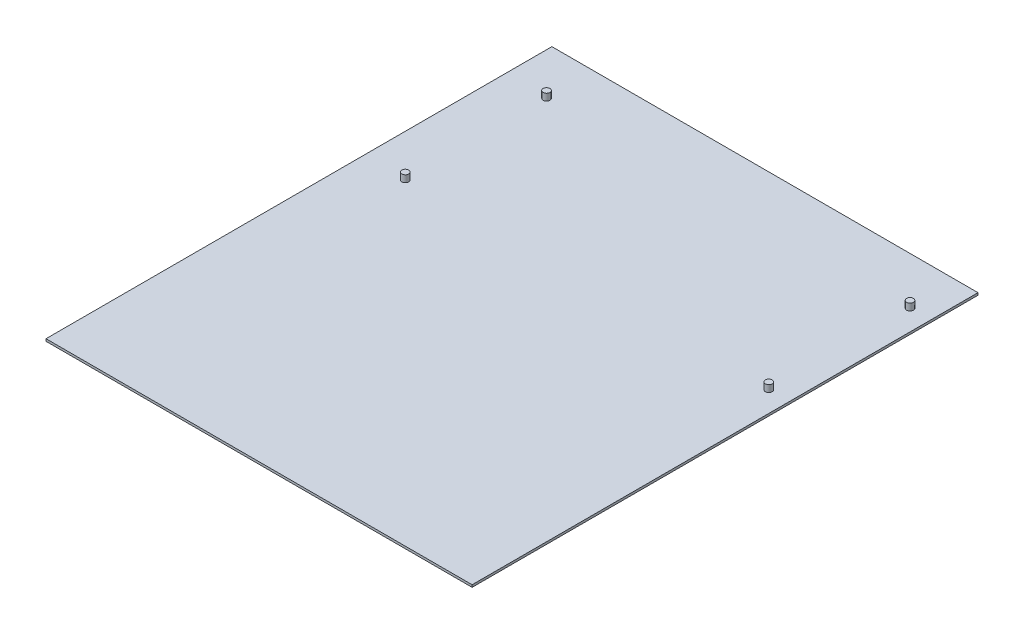
ISO-10303-21;
HEADER;
FILE_DESCRIPTION(('STEP AP214'),'2;1');
FILE_NAME('part.step','',(''),(''),'','','');
FILE_SCHEMA(('AUTOMOTIVE_DESIGN { 1 0 10303 214 1 1 1 1 }'));
ENDSEC;
DATA;
#1=APPLICATION_CONTEXT('core data for automotive mechanical design processes');
#2=APPLICATION_PROTOCOL_DEFINITION('international standard','automotive_design',2000,#1);
#3=PRODUCT_CONTEXT('',#1,'mechanical');
#4=PRODUCT('Part','Part','',(#3));
#5=PRODUCT_RELATED_PRODUCT_CATEGORY('part','',(#4));
#6=PRODUCT_DEFINITION_FORMATION('','',#4);
#7=PRODUCT_DEFINITION_CONTEXT('part definition',#1,'design');
#8=PRODUCT_DEFINITION('design','',#6,#7);
#9=PRODUCT_DEFINITION_SHAPE('','',#8);
#10=(LENGTH_UNIT() NAMED_UNIT(*) SI_UNIT(.MILLI.,.METRE.));
#11=(NAMED_UNIT(*) PLANE_ANGLE_UNIT() SI_UNIT($,.RADIAN.));
#12=(NAMED_UNIT(*) SI_UNIT($,.STERADIAN.) SOLID_ANGLE_UNIT());
#13=UNCERTAINTY_MEASURE_WITH_UNIT(LENGTH_MEASURE(1.E-05),#10,'distance_accuracy_value','');
#14=(GEOMETRIC_REPRESENTATION_CONTEXT(3) GLOBAL_UNCERTAINTY_ASSIGNED_CONTEXT((#13)) GLOBAL_UNIT_ASSIGNED_CONTEXT((#10,
#11,#12)) REPRESENTATION_CONTEXT('',''));
#15=CARTESIAN_POINT('',(0.,0.,0.));
#16=DIRECTION('',(0.,0.,1.));
#17=DIRECTION('',(1.,0.,0.));
#18=AXIS2_PLACEMENT_3D('',#15,#16,#17);
#19=CARTESIAN_POINT('',(-56.1029412418748,1.,35.5374216007363));
#20=DIRECTION('',(0.,1.,0.));
#21=DIRECTION('',(0.,0.,1.));
#22=AXIS2_PLACEMENT_3D('',#19,#20,#21);
#23=PLANE('',#22);
#24=CARTESIAN_POINT('',(121.897058758125,1.,-103.656578399264));
#25=DIRECTION('',(0.,1.,0.));
#26=DIRECTION('',(0.,0.,1.));
#27=AXIS2_PLACEMENT_3D('',#24,#25,#26);
#28=CIRCLE('',#27,1.5);
#29=CARTESIAN_POINT('',(121.897058758125,1.,-102.156578399264));
#30=VERTEX_POINT('',#29);
#31=EDGE_CURVE('E123',#30,#30,#28,.T.);
#32=ORIENTED_EDGE('',*,*,#31,.F.);
#33=EDGE_LOOP('',(#32));
#34=FACE_BOUND('',#33,.T.);
#35=CARTESIAN_POINT('',(121.897058758125,1.,-165.632578399264));
#36=DIRECTION('',(0.,1.,0.));
#37=DIRECTION('',(0.,0.,1.));
#38=AXIS2_PLACEMENT_3D('',#35,#36,#37);
#39=CIRCLE('',#38,1.5);
#40=CARTESIAN_POINT('',(121.897058758125,1.,-164.132578399264));
#41=VERTEX_POINT('',#40);
#42=EDGE_CURVE('E111',#41,#41,#39,.T.);
#43=ORIENTED_EDGE('',*,*,#42,.F.);
#44=EDGE_LOOP('',(#43));
#45=FACE_BOUND('',#44,.T.);
#46=DIRECTION('',(0.,0.,1.));
#47=VECTOR('',#46,1.);
#48=CARTESIAN_POINT('',(-56.1029412418748,1.,-186.462578399264));
#49=LINE('',#48,#47);
#50=CARTESIAN_POINT('',(-56.1029412418748,1.,-186.462578399264));
#51=VERTEX_POINT('',#50);
#52=CARTESIAN_POINT('',(-56.1029412418748,1.,35.5374216007363));
#53=VERTEX_POINT('',#52);
#54=EDGE_CURVE('E85',#51,#53,#49,.T.);
#55=ORIENTED_EDGE('',*,*,#54,.T.);
#56=DIRECTION('',(1.,0.,0.));
#57=VECTOR('',#56,1.);
#58=CARTESIAN_POINT('',(-56.1029412418748,1.,35.5374216007363));
#59=LINE('',#58,#57);
#60=CARTESIAN_POINT('',(130.897058758125,1.,35.5374216007363));
#61=VERTEX_POINT('',#60);
#62=EDGE_CURVE('E80',#53,#61,#59,.T.);
#63=ORIENTED_EDGE('',*,*,#62,.T.);
#64=DIRECTION('',(0.,0.,-1.));
#65=VECTOR('',#64,1.);
#66=CARTESIAN_POINT('',(130.897058758125,1.,-186.462578399264));
#67=LINE('',#66,#65);
#68=CARTESIAN_POINT('',(130.897058758125,1.,-186.462578399264));
#69=VERTEX_POINT('',#68);
#70=EDGE_CURVE('E83',#61,#69,#67,.T.);
#71=ORIENTED_EDGE('',*,*,#70,.T.);
#72=DIRECTION('',(-1.,0.,0.));
#73=VECTOR('',#72,1.);
#74=CARTESIAN_POINT('',(-56.1029412418748,1.,-186.462578399264));
#75=LINE('',#74,#73);
#76=EDGE_CURVE('E50',#69,#51,#75,.T.);
#77=ORIENTED_EDGE('',*,*,#76,.T.);
#78=EDGE_LOOP('',(#55,#63,#71,#77));
#79=FACE_BOUND('',#78,.T.);
#80=CARTESIAN_POINT('',(-37.6149412418748,1.,-165.632578399264));
#81=DIRECTION('',(0.,1.,0.));
#82=DIRECTION('',(0.,0.,1.));
#83=AXIS2_PLACEMENT_3D('',#80,#81,#82);
#84=CIRCLE('',#83,1.5);
#85=CARTESIAN_POINT('',(-37.6149412418748,1.,-164.132578399264));
#86=VERTEX_POINT('',#85);
#87=EDGE_CURVE('E117',#86,#86,#84,.T.);
#88=ORIENTED_EDGE('',*,*,#87,.F.);
#89=EDGE_LOOP('',(#88));
#90=FACE_BOUND('',#89,.T.);
#91=CARTESIAN_POINT('',(-37.6149412418748,1.,-103.652578399264));
#92=DIRECTION('',(0.,1.,0.));
#93=DIRECTION('',(0.,0.,1.));
#94=AXIS2_PLACEMENT_3D('',#91,#92,#93);
#95=CIRCLE('',#94,1.5);
#96=CARTESIAN_POINT('',(-37.6149412418748,1.,-102.152578399264));
#97=VERTEX_POINT('',#96);
#98=EDGE_CURVE('E129',#97,#97,#95,.T.);
#99=ORIENTED_EDGE('',*,*,#98,.F.);
#100=EDGE_LOOP('',(#99));
#101=FACE_BOUND('',#100,.T.);
#102=ADVANCED_FACE('F33',(#34,#45,#79,#90,#101),#23,.T.);
#103=CARTESIAN_POINT('',(-56.1029412418748,1.,-186.462578399264));
#104=DIRECTION('',(1.,0.,0.));
#105=DIRECTION('',(0.,0.,-1.));
#106=AXIS2_PLACEMENT_3D('',#103,#104,#105);
#107=PLANE('',#106);
#108=DIRECTION('',(0.,0.,1.));
#109=VECTOR('',#108,1.);
#110=CARTESIAN_POINT('',(-56.1029412418748,0.,-186.462578399264));
#111=LINE('',#110,#109);
#112=CARTESIAN_POINT('',(-56.1029412418748,0.,-186.462578399264));
#113=VERTEX_POINT('',#112);
#114=CARTESIAN_POINT('',(-56.1029412418748,0.,35.5374216007363));
#115=VERTEX_POINT('',#114);
#116=EDGE_CURVE('E97',#113,#115,#111,.T.);
#117=ORIENTED_EDGE('',*,*,#116,.T.);
#118=DIRECTION('',(0.,-1.,0.));
#119=VECTOR('',#118,1.);
#120=CARTESIAN_POINT('',(-56.1029412418748,1.,35.5374216007363));
#121=LINE('',#120,#119);
#122=EDGE_CURVE('E11',#53,#115,#121,.T.);
#123=ORIENTED_EDGE('',*,*,#122,.F.);
#124=ORIENTED_EDGE('',*,*,#54,.F.);
#125=DIRECTION('',(0.,-1.,0.));
#126=VECTOR('',#125,1.);
#127=CARTESIAN_POINT('',(-56.1029412418748,1.,-186.462578399264));
#128=LINE('',#127,#126);
#129=EDGE_CURVE('E93',#51,#113,#128,.T.);
#130=ORIENTED_EDGE('',*,*,#129,.T.);
#131=EDGE_LOOP('',(#117,#123,#124,#130));
#132=FACE_BOUND('',#131,.T.);
#133=ADVANCED_FACE('F35',(#132),#107,.F.);
#134=CARTESIAN_POINT('',(-56.1029412418748,1.,35.5374216007363));
#135=DIRECTION('',(0.,0.,-1.));
#136=DIRECTION('',(-1.,0.,0.));
#137=AXIS2_PLACEMENT_3D('',#134,#135,#136);
#138=PLANE('',#137);
#139=DIRECTION('',(1.,0.,0.));
#140=VECTOR('',#139,1.);
#141=CARTESIAN_POINT('',(-56.1029412418748,0.,35.5374216007363));
#142=LINE('',#141,#140);
#143=CARTESIAN_POINT('',(130.897058758125,0.,35.5374216007363));
#144=VERTEX_POINT('',#143);
#145=EDGE_CURVE('E89',#115,#144,#142,.T.);
#146=ORIENTED_EDGE('',*,*,#145,.T.);
#147=DIRECTION('',(0.,-1.,0.));
#148=VECTOR('',#147,1.);
#149=CARTESIAN_POINT('',(130.897058758125,1.,35.5374216007363));
#150=LINE('',#149,#148);
#151=EDGE_CURVE('E42',#61,#144,#150,.T.);
#152=ORIENTED_EDGE('',*,*,#151,.F.);
#153=ORIENTED_EDGE('',*,*,#62,.F.);
#154=ORIENTED_EDGE('',*,*,#122,.T.);
#155=EDGE_LOOP('',(#146,#152,#153,#154));
#156=FACE_BOUND('',#155,.T.);
#157=ADVANCED_FACE('F88',(#156),#138,.F.);
#158=CARTESIAN_POINT('',(130.897058758125,1.,-186.462578399264));
#159=DIRECTION('',(-1.,0.,0.));
#160=DIRECTION('',(0.,0.,1.));
#161=AXIS2_PLACEMENT_3D('',#158,#159,#160);
#162=PLANE('',#161);
#163=DIRECTION('',(0.,0.,-1.));
#164=VECTOR('',#163,1.);
#165=CARTESIAN_POINT('',(130.897058758125,0.,-186.462578399264));
#166=LINE('',#165,#164);
#167=CARTESIAN_POINT('',(130.897058758125,0.,-186.462578399264));
#168=VERTEX_POINT('',#167);
#169=EDGE_CURVE('E67',#144,#168,#166,.T.);
#170=ORIENTED_EDGE('',*,*,#169,.T.);
#171=DIRECTION('',(0.,-1.,0.));
#172=VECTOR('',#171,1.);
#173=CARTESIAN_POINT('',(130.897058758125,1.,-186.462578399264));
#174=LINE('',#173,#172);
#175=EDGE_CURVE('E90',#69,#168,#174,.T.);
#176=ORIENTED_EDGE('',*,*,#175,.F.);
#177=ORIENTED_EDGE('',*,*,#70,.F.);
#178=ORIENTED_EDGE('',*,*,#151,.T.);
#179=EDGE_LOOP('',(#170,#176,#177,#178));
#180=FACE_BOUND('',#179,.T.);
#181=ADVANCED_FACE('F91',(#180),#162,.F.);
#182=CARTESIAN_POINT('',(-56.1029412418748,1.,-186.462578399264));
#183=DIRECTION('',(0.,0.,1.));
#184=DIRECTION('',(1.,0.,0.));
#185=AXIS2_PLACEMENT_3D('',#182,#183,#184);
#186=PLANE('',#185);
#187=DIRECTION('',(-1.,0.,0.));
#188=VECTOR('',#187,1.);
#189=CARTESIAN_POINT('',(-56.1029412418748,0.,-186.462578399264));
#190=LINE('',#189,#188);
#191=EDGE_CURVE('E73',#168,#113,#190,.T.);
#192=ORIENTED_EDGE('',*,*,#191,.T.);
#193=ORIENTED_EDGE('',*,*,#129,.F.);
#194=ORIENTED_EDGE('',*,*,#76,.F.);
#195=ORIENTED_EDGE('',*,*,#175,.T.);
#196=EDGE_LOOP('',(#192,#193,#194,#195));
#197=FACE_BOUND('',#196,.T.);
#198=ADVANCED_FACE('F105',(#197),#186,.F.);
#199=CARTESIAN_POINT('',(-56.1029412418748,0.,35.5374216007363));
#200=DIRECTION('',(0.,1.,0.));
#201=DIRECTION('',(0.,0.,1.));
#202=AXIS2_PLACEMENT_3D('',#199,#200,#201);
#203=PLANE('',#202);
#204=ORIENTED_EDGE('',*,*,#116,.F.);
#205=ORIENTED_EDGE('',*,*,#191,.F.);
#206=ORIENTED_EDGE('',*,*,#169,.F.);
#207=ORIENTED_EDGE('',*,*,#145,.F.);
#208=EDGE_LOOP('',(#204,#205,#206,#207));
#209=FACE_BOUND('',#208,.T.);
#210=ADVANCED_FACE('F108',(#209),#203,.F.);
#211=CARTESIAN_POINT('',(121.897058758125,4.,-165.632578399264));
#212=DIRECTION('',(0.,-1.,0.));
#213=DIRECTION('',(0.,0.,-1.));
#214=AXIS2_PLACEMENT_3D('',#211,#212,#213);
#215=CYLINDRICAL_SURFACE('',#214,1.5);
#216=CARTESIAN_POINT('',(121.897058758125,4.,-165.632578399264));
#217=DIRECTION('',(0.,1.,0.));
#218=DIRECTION('',(0.,0.,1.));
#219=AXIS2_PLACEMENT_3D('',#216,#217,#218);
#220=CIRCLE('',#219,1.5);
#221=CARTESIAN_POINT('',(121.897058758125,4.,-164.132578399264));
#222=VERTEX_POINT('',#221);
#223=EDGE_CURVE('E100',#222,#222,#220,.T.);
#224=ORIENTED_EDGE('',*,*,#223,.F.);
#225=EDGE_LOOP('',(#224));
#226=FACE_BOUND('',#225,.T.);
#227=ORIENTED_EDGE('',*,*,#42,.T.);
#228=EDGE_LOOP('',(#227));
#229=FACE_BOUND('',#228,.T.);
#230=ADVANCED_FACE('F156',(#226,#229),#215,.T.);
#231=CARTESIAN_POINT('',(121.897058758125,4.,-165.632578399264));
#232=DIRECTION('',(0.,1.,0.));
#233=DIRECTION('',(0.,0.,1.));
#234=AXIS2_PLACEMENT_3D('',#231,#232,#233);
#235=PLANE('',#234);
#236=ORIENTED_EDGE('',*,*,#223,.T.);
#237=EDGE_LOOP('',(#236));
#238=FACE_BOUND('',#237,.T.);
#239=ADVANCED_FACE('F189',(#238),#235,.T.);
#240=CARTESIAN_POINT('',(-37.6149412418748,4.,-165.632578399264));
#241=DIRECTION('',(0.,-1.,0.));
#242=DIRECTION('',(0.,0.,-1.));
#243=AXIS2_PLACEMENT_3D('',#240,#241,#242);
#244=CYLINDRICAL_SURFACE('',#243,1.5);
#245=CARTESIAN_POINT('',(-37.6149412418748,4.,-165.632578399264));
#246=DIRECTION('',(0.,1.,0.));
#247=DIRECTION('',(0.,0.,1.));
#248=AXIS2_PLACEMENT_3D('',#245,#246,#247);
#249=CIRCLE('',#248,1.5);
#250=CARTESIAN_POINT('',(-37.6149412418748,4.,-164.132578399264));
#251=VERTEX_POINT('',#250);
#252=EDGE_CURVE('E114',#251,#251,#249,.T.);
#253=ORIENTED_EDGE('',*,*,#252,.F.);
#254=EDGE_LOOP('',(#253));
#255=FACE_BOUND('',#254,.T.);
#256=ORIENTED_EDGE('',*,*,#87,.T.);
#257=EDGE_LOOP('',(#256));
#258=FACE_BOUND('',#257,.T.);
#259=ADVANCED_FACE('F195',(#255,#258),#244,.T.);
#260=CARTESIAN_POINT('',(-37.6149412418748,4.,-165.632578399264));
#261=DIRECTION('',(0.,1.,0.));
#262=DIRECTION('',(0.,0.,1.));
#263=AXIS2_PLACEMENT_3D('',#260,#261,#262);
#264=PLANE('',#263);
#265=ORIENTED_EDGE('',*,*,#252,.T.);
#266=EDGE_LOOP('',(#265));
#267=FACE_BOUND('',#266,.T.);
#268=ADVANCED_FACE('F202',(#267),#264,.T.);
#269=CARTESIAN_POINT('',(121.897058758125,4.,-103.656578399264));
#270=DIRECTION('',(0.,-1.,0.));
#271=DIRECTION('',(0.,0.,-1.));
#272=AXIS2_PLACEMENT_3D('',#269,#270,#271);
#273=CYLINDRICAL_SURFACE('',#272,1.5);
#274=CARTESIAN_POINT('',(121.897058758125,4.,-103.656578399264));
#275=DIRECTION('',(0.,1.,0.));
#276=DIRECTION('',(0.,0.,1.));
#277=AXIS2_PLACEMENT_3D('',#274,#275,#276);
#278=CIRCLE('',#277,1.5);
#279=CARTESIAN_POINT('',(121.897058758125,4.,-102.156578399264));
#280=VERTEX_POINT('',#279);
#281=EDGE_CURVE('E120',#280,#280,#278,.T.);
#282=ORIENTED_EDGE('',*,*,#281,.F.);
#283=EDGE_LOOP('',(#282));
#284=FACE_BOUND('',#283,.T.);
#285=ORIENTED_EDGE('',*,*,#31,.T.);
#286=EDGE_LOOP('',(#285));
#287=FACE_BOUND('',#286,.T.);
#288=ADVANCED_FACE('F210',(#284,#287),#273,.T.);
#289=CARTESIAN_POINT('',(121.897058758125,4.,-103.656578399264));
#290=DIRECTION('',(0.,1.,0.));
#291=DIRECTION('',(0.,0.,1.));
#292=AXIS2_PLACEMENT_3D('',#289,#290,#291);
#293=PLANE('',#292);
#294=ORIENTED_EDGE('',*,*,#281,.T.);
#295=EDGE_LOOP('',(#294));
#296=FACE_BOUND('',#295,.T.);
#297=ADVANCED_FACE('F140',(#296),#293,.T.);
#298=CARTESIAN_POINT('',(-37.6149412418748,4.,-103.652578399264));
#299=DIRECTION('',(0.,-1.,0.));
#300=DIRECTION('',(0.,0.,-1.));
#301=AXIS2_PLACEMENT_3D('',#298,#299,#300);
#302=CYLINDRICAL_SURFACE('',#301,1.5);
#303=CARTESIAN_POINT('',(-37.6149412418748,4.,-103.652578399264));
#304=DIRECTION('',(0.,1.,0.));
#305=DIRECTION('',(0.,0.,1.));
#306=AXIS2_PLACEMENT_3D('',#303,#304,#305);
#307=CIRCLE('',#306,1.5);
#308=CARTESIAN_POINT('',(-37.6149412418748,4.,-102.152578399264));
#309=VERTEX_POINT('',#308);
#310=EDGE_CURVE('E126',#309,#309,#307,.T.);
#311=ORIENTED_EDGE('',*,*,#310,.F.);
#312=EDGE_LOOP('',(#311));
#313=FACE_BOUND('',#312,.T.);
#314=ORIENTED_EDGE('',*,*,#98,.T.);
#315=EDGE_LOOP('',(#314));
#316=FACE_BOUND('',#315,.T.);
#317=ADVANCED_FACE('F137',(#313,#316),#302,.T.);
#318=CARTESIAN_POINT('',(-37.6149412418748,4.,-103.652578399264));
#319=DIRECTION('',(0.,1.,0.));
#320=DIRECTION('',(0.,0.,1.));
#321=AXIS2_PLACEMENT_3D('',#318,#319,#320);
#322=PLANE('',#321);
#323=ORIENTED_EDGE('',*,*,#310,.T.);
#324=EDGE_LOOP('',(#323));
#325=FACE_BOUND('',#324,.T.);
#326=ADVANCED_FACE('F135',(#325),#322,.T.);
#327=CLOSED_SHELL('',(#102,#133,#157,#181,#198,#210,#230,#239,#259,#268,#288,#297,#317,#326));
#328=MANIFOLD_SOLID_BREP('B2',#327);
#329=ADVANCED_BREP_SHAPE_REPRESENTATION('',(#18,#328),#14);
#330=SHAPE_DEFINITION_REPRESENTATION(#9,#329);
ENDSEC;
END-ISO-10303-21;
